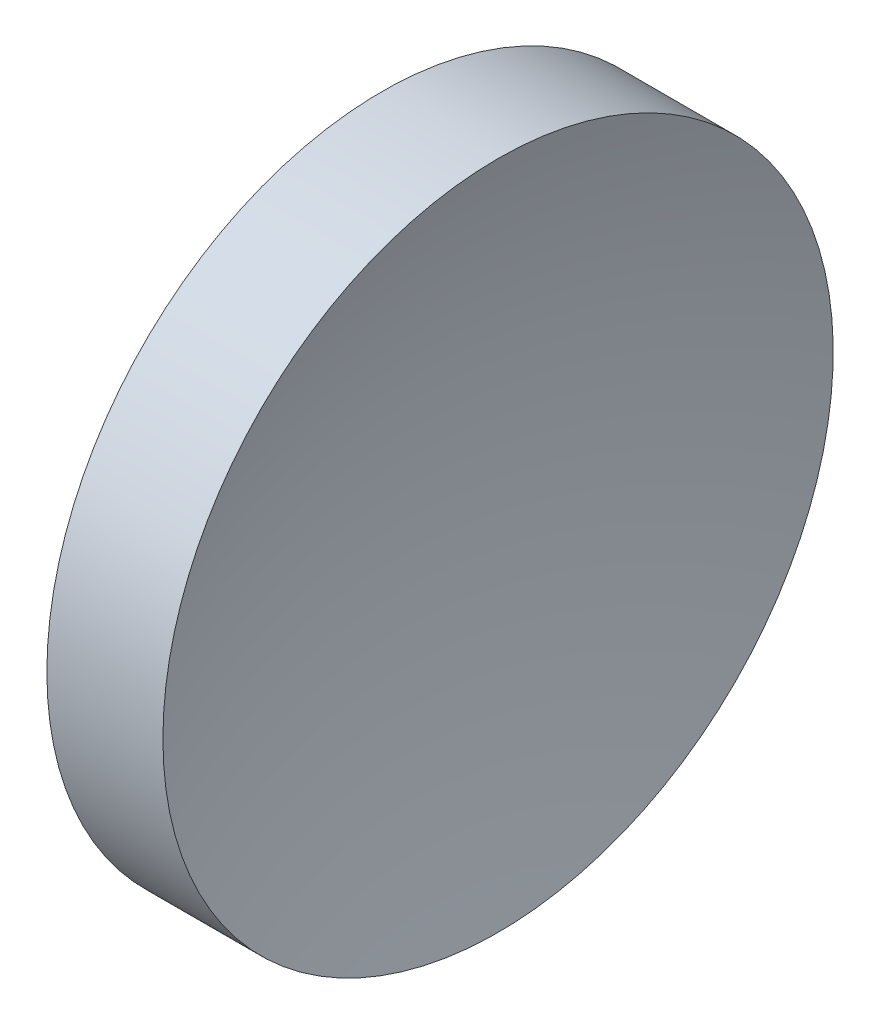
ISO-10303-21;
HEADER;
FILE_DESCRIPTION(('STEP AP214'),'2;1');
FILE_NAME('part.step','',(''),(''),'','','');
FILE_SCHEMA(('AUTOMOTIVE_DESIGN { 1 0 10303 214 1 1 1 1 }'));
ENDSEC;
DATA;
#1=APPLICATION_CONTEXT('core data for automotive mechanical design processes');
#2=APPLICATION_PROTOCOL_DEFINITION('international standard','automotive_design',2000,#1);
#3=PRODUCT_CONTEXT('',#1,'mechanical');
#4=PRODUCT('Part','Part','',(#3));
#5=PRODUCT_RELATED_PRODUCT_CATEGORY('part','',(#4));
#6=PRODUCT_DEFINITION_FORMATION('','',#4);
#7=PRODUCT_DEFINITION_CONTEXT('part definition',#1,'design');
#8=PRODUCT_DEFINITION('design','',#6,#7);
#9=PRODUCT_DEFINITION_SHAPE('','',#8);
#10=(LENGTH_UNIT() NAMED_UNIT(*) SI_UNIT(.MILLI.,.METRE.));
#11=(NAMED_UNIT(*) PLANE_ANGLE_UNIT() SI_UNIT($,.RADIAN.));
#12=(NAMED_UNIT(*) SI_UNIT($,.STERADIAN.) SOLID_ANGLE_UNIT());
#13=UNCERTAINTY_MEASURE_WITH_UNIT(LENGTH_MEASURE(1.E-05),#10,'distance_accuracy_value','');
#14=(GEOMETRIC_REPRESENTATION_CONTEXT(3) GLOBAL_UNCERTAINTY_ASSIGNED_CONTEXT((#13)) GLOBAL_UNIT_ASSIGNED_CONTEXT((#10,
#11,#12)) REPRESENTATION_CONTEXT('',''));
#15=CARTESIAN_POINT('',(0.,0.,0.));
#16=DIRECTION('',(0.,0.,1.));
#17=DIRECTION('',(1.,0.,0.));
#18=AXIS2_PLACEMENT_3D('',#15,#16,#17);
#19=CARTESIAN_POINT('',(71.6591529031853,26.089041149195,0.));
#20=DIRECTION('',(-1.,0.,0.));
#21=DIRECTION('',(0.,1.,0.));
#22=AXIS2_PLACEMENT_3D('',#19,#20,#21);
#23=SPHERICAL_SURFACE('',#22,25.84);
#24=CARTESIAN_POINT('',(47.0887316613751,26.089041149195,0.));
#25=DIRECTION('',(-1.,0.,0.));
#26=DIRECTION('',(0.,0.,1.));
#27=AXIS2_PLACEMENT_3D('',#24,#25,#26);
#28=CIRCLE('',#27,8.);
#29=CARTESIAN_POINT('',(47.0887316613751,26.089041149195,8.));
#30=VERTEX_POINT('',#29);
#31=EDGE_CURVE('E10',#30,#30,#28,.T.);
#32=ORIENTED_EDGE('',*,*,#31,.F.);
#33=EDGE_LOOP('',(#32));
#34=FACE_BOUND('',#33,.T.);
#35=ADVANCED_FACE('F33',(#34),#23,.F.);
#36=CARTESIAN_POINT('',(42.4498611141368,26.089041149195,0.));
#37=DIRECTION('',(-1.,0.,0.));
#38=DIRECTION('',(0.,0.,1.));
#39=AXIS2_PLACEMENT_3D('',#36,#37,#38);
#40=CYLINDRICAL_SURFACE('',#39,8.);
#41=CARTESIAN_POINT('',(44.3191526931544,26.089041149195,0.));
#42=DIRECTION('',(-1.,0.,0.));
#43=DIRECTION('',(0.,0.,1.));
#44=AXIS2_PLACEMENT_3D('',#41,#42,#43);
#45=CIRCLE('',#44,8.);
#46=CARTESIAN_POINT('',(44.3191526931544,26.089041149195,8.));
#47=VERTEX_POINT('',#46);
#48=EDGE_CURVE('E39',#47,#47,#45,.T.);
#49=ORIENTED_EDGE('',*,*,#48,.F.);
#50=EDGE_LOOP('',(#49));
#51=FACE_BOUND('',#50,.T.);
#52=ORIENTED_EDGE('',*,*,#31,.T.);
#53=EDGE_LOOP('',(#52));
#54=FACE_BOUND('',#53,.T.);
#55=ADVANCED_FACE('F47',(#51,#54),#40,.T.);
#56=CARTESIAN_POINT('',(44.3191526931544,26.089041149195,0.));
#57=DIRECTION('',(1.,0.,0.));
#58=DIRECTION('',(0.,0.,-1.));
#59=AXIS2_PLACEMENT_3D('',#56,#57,#58);
#60=PLANE('',#59);
#61=ORIENTED_EDGE('',*,*,#48,.T.);
#62=EDGE_LOOP('',(#61));
#63=FACE_BOUND('',#62,.T.);
#64=ADVANCED_FACE('F45',(#63),#60,.F.);
#65=CLOSED_SHELL('',(#35,#55,#64));
#66=MANIFOLD_SOLID_BREP('B2',#65);
#67=ADVANCED_BREP_SHAPE_REPRESENTATION('',(#18,#66),#14);
#68=SHAPE_DEFINITION_REPRESENTATION(#9,#67);
ENDSEC;
END-ISO-10303-21;
